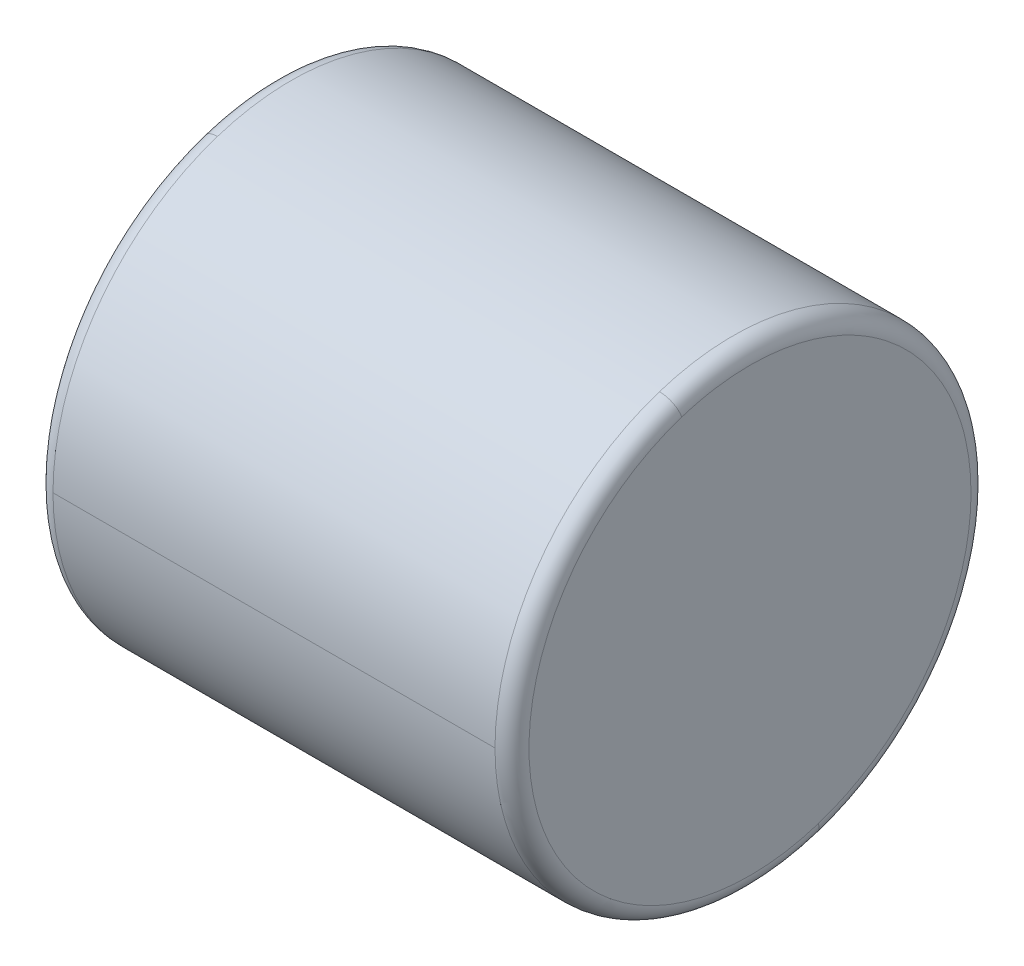
ISO-10303-21;
HEADER;
FILE_DESCRIPTION(('STEP AP214'),'2;1');
FILE_NAME('part.step','',(''),(''),'','','');
FILE_SCHEMA(('AUTOMOTIVE_DESIGN { 1 0 10303 214 1 1 1 1 }'));
ENDSEC;
DATA;
#1=APPLICATION_CONTEXT('core data for automotive mechanical design processes');
#2=APPLICATION_PROTOCOL_DEFINITION('international standard','automotive_design',2000,#1);
#3=PRODUCT_CONTEXT('',#1,'mechanical');
#4=PRODUCT('Part','Part','',(#3));
#5=PRODUCT_RELATED_PRODUCT_CATEGORY('part','',(#4));
#6=PRODUCT_DEFINITION_FORMATION('','',#4);
#7=PRODUCT_DEFINITION_CONTEXT('part definition',#1,'design');
#8=PRODUCT_DEFINITION('design','',#6,#7);
#9=PRODUCT_DEFINITION_SHAPE('','',#8);
#10=(LENGTH_UNIT() NAMED_UNIT(*) SI_UNIT(.MILLI.,.METRE.));
#11=(NAMED_UNIT(*) PLANE_ANGLE_UNIT() SI_UNIT($,.RADIAN.));
#12=(NAMED_UNIT(*) SI_UNIT($,.STERADIAN.) SOLID_ANGLE_UNIT());
#13=UNCERTAINTY_MEASURE_WITH_UNIT(LENGTH_MEASURE(1.E-05),#10,'distance_accuracy_value','');
#14=(GEOMETRIC_REPRESENTATION_CONTEXT(3) GLOBAL_UNCERTAINTY_ASSIGNED_CONTEXT((#13)) GLOBAL_UNIT_ASSIGNED_CONTEXT((#10,
#11,#12)) REPRESENTATION_CONTEXT('',''));
#15=CARTESIAN_POINT('',(0.,0.,0.));
#16=DIRECTION('',(0.,0.,1.));
#17=DIRECTION('',(1.,0.,0.));
#18=AXIS2_PLACEMENT_3D('',#15,#16,#17);
#19=CARTESIAN_POINT('',(4.,43.,0.));
#20=DIRECTION('',(1.,0.,0.));
#21=DIRECTION('',(0.,0.,-1.));
#22=AXIS2_PLACEMENT_3D('',#19,#20,#21);
#23=PLANE('',#22);
#24=CARTESIAN_POINT('',(4.,49.1818673559181,2.00861046343702));
#25=CARTESIAN_POINT('',(4.,49.1490036565323,2.10976183082609));
#26=CARTESIAN_POINT('',(4.,49.1136531930902,2.21010499774414));
#27=CARTESIAN_POINT('',(4.,49.0380731706768,2.40893671890096));
#28=CARTESIAN_POINT('',(4.,48.9978436117054,2.50742527313974));
#29=CARTESIAN_POINT('',(4.,48.9125998308166,2.70230955720075));
#30=CARTESIAN_POINT('',(4.,48.8675856088991,2.79870528702298));
#31=CARTESIAN_POINT('',(4.,48.7728816108932,2.98917194948772));
#32=CARTESIAN_POINT('',(4.,48.7231918348049,3.08324288213022));
#33=CARTESIAN_POINT('',(4.,48.6192562571407,3.26883325732977));
#34=CARTESIAN_POINT('',(4.,48.565010455565,3.36035269988683));
#35=CARTESIAN_POINT('',(4.,48.4520935575993,3.54061963472633));
#36=CARTESIAN_POINT('',(4.,48.3934224612094,3.62936712700877));
#37=CARTESIAN_POINT('',(4.,48.2717963046215,3.8038763559497));
#38=CARTESIAN_POINT('',(4.,48.2088412444235,3.88963809260819));
#39=CARTESIAN_POINT('',(4.,48.0787988279044,4.0579692040699));
#40=CARTESIAN_POINT('',(4.,48.0117114715833,4.14053857887311));
#41=CARTESIAN_POINT('',(4.,47.8735660812164,4.30228604941871));
#42=CARTESIAN_POINT('',(4.,47.8025080471705,4.38146414516109));
#43=CARTESIAN_POINT('',(4.,47.6565924866283,4.53623831071082));
#44=CARTESIAN_POINT('',(4.,47.5817349601319,4.61183438051817));
#45=CARTESIAN_POINT('',(4.,47.4284007529607,4.75926237661915));
#46=CARTESIAN_POINT('',(4.,47.3499240722859,4.83109430291278));
#47=CARTESIAN_POINT('',(4.,47.189540613973,4.97082096259087));
#48=CARTESIAN_POINT('',(4.,47.107633836335,5.03871569597533));
#49=CARTESIAN_POINT('',(4.,46.9405875046923,5.17040440547367));
#50=CARTESIAN_POINT('',(4.,46.8554479506878,5.23419838158756));
#51=CARTESIAN_POINT('',(4.,46.6821411749564,5.35753189126909));
#52=CARTESIAN_POINT('',(4.,46.5939739532296,5.41707142483674));
#53=CARTESIAN_POINT('',(4.,46.414824244613,5.53175261347425));
#54=CARTESIAN_POINT('',(4.,46.3238417577232,5.58689426854412));
#55=CARTESIAN_POINT('',(4.,46.1392807035609,5.6926468591092));
#56=CARTESIAN_POINT('',(4.,46.0457021362883,5.74325779460442));
#57=CARTESIAN_POINT('',(4.,45.8561743603254,5.83982701984359));
#58=CARTESIAN_POINT('',(4.,45.7602251516351,5.88578530958755));
#59=CARTESIAN_POINT('',(4.,45.5661872428846,5.97293852577874));
#60=CARTESIAN_POINT('',(4.,45.4680985428244,6.01413345222598));
#61=CARTESIAN_POINT('',(4.,45.2700179556042,6.09166069963766));
#62=CARTESIAN_POINT('',(4.,45.1700260684442,6.12799302060212));
#63=CARTESIAN_POINT('',(4.,44.9683799962387,6.1957075293047));
#64=CARTESIAN_POINT('',(4.,44.8667258111932,6.22708971704283));
#65=CARTESIAN_POINT('',(4.,44.6620000370525,6.28482835685375));
#66=CARTESIAN_POINT('',(4.,44.5589284479572,6.31118480892654));
#67=CARTESIAN_POINT('',(4.,44.3516161742031,6.3588084824052));
#68=CARTESIAN_POINT('',(4.,44.2473754895441,6.38007570381106));
#69=CARTESIAN_POINT('',(4.,44.0379761496023,6.41746968135668));
#70=CARTESIAN_POINT('',(4.,43.9328174943195,6.43359643749646));
#71=CARTESIAN_POINT('',(4.,43.7218355495413,6.46067063374183));
#72=CARTESIAN_POINT('',(4.,43.6160122600459,6.47161807384743));
#73=CARTESIAN_POINT('',(4.,43.403955984416,6.48830726468237));
#74=CARTESIAN_POINT('',(4.,43.2977229982815,6.49404901541171));
#75=CARTESIAN_POINT('',(4.,43.085103253942,6.5003129951137));
#76=CARTESIAN_POINT('',(4.,42.9787164957369,6.50083522408635));
#77=CARTESIAN_POINT('',(4.,42.766045502275,6.49665890217963));
#78=CARTESIAN_POINT('',(4.,42.6597612670182,6.49196035130025));
#79=CARTESIAN_POINT('',(4.,42.447551367485,6.47735378891009));
#80=CARTESIAN_POINT('',(4.,42.3416257032086,6.4674457773993));
#81=CARTESIAN_POINT('',(4.,42.1303881298396,6.44244416301388));
#82=CARTESIAN_POINT('',(4.,42.0250762207469,6.42735056013925));
#83=CARTESIAN_POINT('',(4.,41.8153198633583,6.39201412483752));
#84=CARTESIAN_POINT('',(4.,41.7108754150625,6.37177129241041));
#85=CARTESIAN_POINT('',(4.,41.503105595092,6.3261851647601));
#86=CARTESIAN_POINT('',(4.,41.3997802234173,6.3008418695369));
#87=CARTESIAN_POINT('',(4.,41.1944974765596,6.2451158705124));
#88=CARTESIAN_POINT('',(4.,41.0925401013765,6.2147331667111));
#89=CARTESIAN_POINT('',(4.,40.8902389717494,6.14900154512508));
#90=CARTESIAN_POINT('',(4.,40.7898952173053,6.11365262734036));
#91=CARTESIAN_POINT('',(4.,40.5910630660496,6.03807373642664));
#92=CARTESIAN_POINT('',(4.,40.4925746692379,5.99784376329764));
#93=CARTESIAN_POINT('',(4.,40.2976905004216,5.91259967922435));
#94=CARTESIAN_POINT('',(4.,40.2012947284169,5.86758556828006));
#95=CARTESIAN_POINT('',(4.,40.0108280350724,5.77288165151224));
#96=CARTESIAN_POINT('',(4.,39.9167571137327,5.7231918456887));
#97=CARTESIAN_POINT('',(4.,39.7311667468073,5.61925624625692));
#98=CARTESIAN_POINT('',(4.,39.6396473012217,5.56501045264868));
#99=CARTESIAN_POINT('',(4.,39.4593803641651,5.45209356051565));
#100=CARTESIAN_POINT('',(4.,39.3706328726942,5.39342246199088));
#101=CARTESIAN_POINT('',(4.,39.1961236443473,5.27179630384011));
#102=CARTESIAN_POINT('',(4.,39.1103619074714,5.20884124421412));
#103=CARTESIAN_POINT('',(4.,38.9420307958505,5.07879882811379));
#104=CARTESIAN_POINT('',(4.,38.8594614211056,5.01171147163945));
#105=CARTESIAN_POINT('',(4.,38.6977139506026,4.87356608116032));
#106=CARTESIAN_POINT('',(4.,38.6185358548446,4.80250804715552));
#107=CARTESIAN_POINT('',(4.,38.4637616892835,4.65659248664335));
#108=CARTESIAN_POINT('',(4.,38.3881656194803,4.58173496013597));
#109=CARTESIAN_POINT('',(4.,38.2407376233824,4.42840075295672));
#110=CARTESIAN_POINT('',(4.,38.1689056970876,4.34992407228486));
#111=CARTESIAN_POINT('',(4.,38.0291790374087,4.18954061397413));
#112=CARTESIAN_POINT('',(4.,37.9612843040246,4.10763383633527));
#113=CARTESIAN_POINT('',(4.,37.8295955945264,3.94058750469206));
#114=CARTESIAN_POINT('',(4.,37.7658016184125,3.85544795068772));
#115=CARTESIAN_POINT('',(4.,37.6424681087309,3.68214117495649));
#116=CARTESIAN_POINT('',(4.,37.5829285751633,3.5939739532296));
#117=CARTESIAN_POINT('',(4.,37.4682473865258,3.41482424461297));
#118=CARTESIAN_POINT('',(4.,37.4131057314559,3.32384175772322));
#119=CARTESIAN_POINT('',(4.,37.3073531408908,3.1392807035609));
#120=CARTESIAN_POINT('',(4.,37.2567422053956,3.04570213628832));
#121=CARTESIAN_POINT('',(4.,37.1601729801564,2.85617436032543));
#122=CARTESIAN_POINT('',(4.,37.1142146904125,2.76022515163511));
#123=CARTESIAN_POINT('',(4.,37.0270614742213,2.56618724288461));
#124=CARTESIAN_POINT('',(4.,36.985866547774,2.46809854282443));
#125=CARTESIAN_POINT('',(4.,36.9083393003624,2.27001795560423));
#126=CARTESIAN_POINT('',(4.,36.872006979398,2.17002606844422));
#127=CARTESIAN_POINT('',(4.,36.8042924706952,1.96837999623869));
#128=CARTESIAN_POINT('',(4.,36.7729102829569,1.86672581119317));
#129=CARTESIAN_POINT('',(4.,36.7151716431465,1.6620000370526));
#130=CARTESIAN_POINT('',(4.,36.6888151910746,1.55892844795756));
#131=CARTESIAN_POINT('',(4.,36.6411915175937,1.35161617420277));
#132=CARTESIAN_POINT('',(4.,36.6199242961848,1.24737548954301));
#133=CARTESIAN_POINT('',(4.,36.5825303186475,1.03797614960349));
#134=CARTESIAN_POINT('',(4.,36.5664035625191,0.93281749432373));
#135=CARTESIAN_POINT('',(4.,36.5393293662426,0.72183554953708));
#136=CARTESIAN_POINT('',(4.,36.5283819260946,0.61601226003019));
#137=CARTESIAN_POINT('',(4.,36.5116927353755,0.403955984431771));
#138=CARTESIAN_POINT('',(4.,36.5059509848045,0.297722998340242));
#139=CARTESIAN_POINT('',(4.,36.4996870046701,0.0851032538832987));
#140=CARTESIAN_POINT('',(4.,36.4991647751069,-0.0212835044821154));
#141=CARTESIAN_POINT('',(4.,36.5033410986271,-0.233954497505988));
#142=CARTESIAN_POINT('',(4.,36.5080396517107,-0.340238732164446));
#143=CARTESIAN_POINT('',(4.,36.522646208079,-0.552448633332304));
#144=CARTESIAN_POINT('',(4.,36.5325542113638,-0.658374299841702));
#145=CARTESIAN_POINT('',(4.,36.557555848223,-0.869611867110034));
#146=CARTESIAN_POINT('',(4.,36.5726494817975,-0.974923767868967));
#147=CARTESIAN_POINT('',(4.,36.6079858332257,-1.18468014802579));
#148=CARTESIAN_POINT('',(4.,36.6282285510794,-1.28912462742367));
#149=CARTESIAN_POINT('',(4.,36.6738149917501,-1.49689436242175));
#150=CARTESIAN_POINT('',(4.,36.6991587145672,-1.60021961802193));
#151=CARTESIAN_POINT('',(4.,36.7548835453835,-1.80550268200117));
#152=CARTESIAN_POINT('',(4.,36.7852646533825,-1.90746049038023));
#153=CARTESIAN_POINT('',(4.,36.8181326440819,-2.008610463437));
#154=B_SPLINE_CURVE_WITH_KNOTS('',3,(#24,#25,#26,#27,#28,#29,#30,#31,#32,#33,#34,#35,#36,#37,
#38,#39,#40,#41,#42,#43,#44,#45,#46,#47,#48,#49,#50,#51,#52,#53,#54,#55,#56,#57,#58,#59,#60,#61,
#62,#63,#64,#65,#66,#67,#68,#69,#70,#71,#72,#73,#74,#75,#76,#77,#78,#79,#80,#81,#82,#83,#84,#85,
#86,#87,#88,#89,#90,#91,#92,#93,#94,#95,#96,#97,#98,#99,#100,#101,#102,#103,#104,#105,#106,#107,
#108,#109,#110,#111,#112,#113,#114,#115,#116,#117,#118,#119,#120,#121,#122,#123,#124,#125,#126,
#127,#128,#129,#130,#131,#132,#133,#134,#135,#136,#137,#138,#139,#140,#141,#142,#143,#144,#145,
#146,#147,#148,#149,#150,#151,#152,#153),.UNSPECIFIED.,.F.,.F.,(4,2,2,2,2,2,2,2,2,2,2,2,2,2,2,2,
2,2,2,2,2,2,2,2,2,2,2,2,2,2,2,2,2,2,2,2,2,2,2,2,2,2,2,2,2,2,2,2,2,2,2,2,2,2,2,2,2,2,2,2,2,2,2,2,
4),(0.,0.31903597079784,0.638071941595675,0.957107912393514,1.27614388319135,1.59517985398919,
1.91421582478703,2.23325179558487,2.55228776638271,2.87132373718054,3.19035970797838,
3.50939567877622,3.82843164957406,4.1474676203719,4.46650359116974,4.78553956196757,
5.10457553276541,5.42361150356325,5.74264747436109,6.06168344515893,6.38071941595676,
6.6997553867546,7.01879135755244,7.33782732835028,7.65686329914812,7.97589926994596,
8.29493524074379,8.61397121154163,8.93300718233947,9.25204315313731,9.57107912393515,
9.89011509473298,10.2091510655308,10.5281870363287,10.8472230071265,11.1662589779243,
11.4852949487222,11.80433091952,12.1233668903179,12.4424028611157,12.7614388319135,
13.0804748027114,13.3995107735092,13.718546744307,14.0375827151049,14.3566186859027,
14.6756546567006,14.9946906274984,15.3137265982962,15.6327625690941,15.9517985398919,
16.2708345106897,16.5898704814876,16.9089064522854,17.2279424230833,17.5469783938811,
17.8660143646789,18.1850503354768,18.5040863062746,18.8231222770725,19.1421582478703,
19.4611942186681,19.780230189466,20.0992661602638,20.4183021310616),.UNSPECIFIED.);
#155=CARTESIAN_POINT('',(4.,49.1818673559181,2.00861046343702));
#156=VERTEX_POINT('',#155);
#157=CARTESIAN_POINT('',(4.,36.8181326440819,-2.00861046343702));
#158=VERTEX_POINT('',#157);
#159=EDGE_CURVE('E11',#156,#158,#154,.T.);
#160=ORIENTED_EDGE('',*,*,#159,.F.);
#161=CARTESIAN_POINT('',(4.,36.8181326440819,-2.00861046343702));
#162=CARTESIAN_POINT('',(4.,36.8509963434677,-2.10976183082608));
#163=CARTESIAN_POINT('',(4.,36.8863468069098,-2.21010499774414));
#164=CARTESIAN_POINT('',(4.,36.9619268293232,-2.40893671890096));
#165=CARTESIAN_POINT('',(4.,37.0021563882946,-2.50742527313974));
#166=CARTESIAN_POINT('',(4.,37.0874001691834,-2.70230955720075));
#167=CARTESIAN_POINT('',(4.,37.1324143911009,-2.79870528702298));
#168=CARTESIAN_POINT('',(4.,37.2271183891068,-2.98917194948772));
#169=CARTESIAN_POINT('',(4.,37.2768081651951,-3.08324288213022));
#170=CARTESIAN_POINT('',(4.,37.3807437428592,-3.26883325732977));
#171=CARTESIAN_POINT('',(4.,37.434989544435,-3.36035269988683));
#172=CARTESIAN_POINT('',(4.,37.5479064424007,-3.54061963472633));
#173=CARTESIAN_POINT('',(4.,37.6065775387906,-3.62936712700877));
#174=CARTESIAN_POINT('',(4.,37.7282036953785,-3.80387635594969));
#175=CARTESIAN_POINT('',(4.,37.7911587555765,-3.88963809260819));
#176=CARTESIAN_POINT('',(4.,37.9212011720956,-4.05796920406989));
#177=CARTESIAN_POINT('',(4.,37.9882885284167,-4.14053857887311));
#178=CARTESIAN_POINT('',(4.,38.1264339187836,-4.30228604941871));
#179=CARTESIAN_POINT('',(4.,38.1974919528295,-4.38146414516109));
#180=CARTESIAN_POINT('',(4.,38.3434075133717,-4.53623831071082));
#181=CARTESIAN_POINT('',(4.,38.4182650398681,-4.61183438051817));
#182=CARTESIAN_POINT('',(4.,38.5715992470393,-4.75926237661915));
#183=CARTESIAN_POINT('',(4.,38.6500759277141,-4.83109430291278));
#184=CARTESIAN_POINT('',(4.,38.8104593860269,-4.97082096259087));
#185=CARTESIAN_POINT('',(4.,38.892366163665,-5.03871569597533));
#186=CARTESIAN_POINT('',(4.,39.0594124953076,-5.17040440547367));
#187=CARTESIAN_POINT('',(4.,39.1445520493122,-5.23419838158756));
#188=CARTESIAN_POINT('',(4.,39.3178588250436,-5.35753189126909));
#189=CARTESIAN_POINT('',(4.,39.4060260467704,-5.41707142483674));
#190=CARTESIAN_POINT('',(4.,39.585175755387,-5.53175261347425));
#191=CARTESIAN_POINT('',(4.,39.6761582422768,-5.58689426854411));
#192=CARTESIAN_POINT('',(4.,39.8607192964391,-5.6926468591092));
#193=CARTESIAN_POINT('',(4.,39.9542978637117,-5.74325779460441));
#194=CARTESIAN_POINT('',(4.,40.1438256396746,-5.83982701984359));
#195=CARTESIAN_POINT('',(4.,40.2397748483649,-5.88578530958755));
#196=CARTESIAN_POINT('',(4.,40.4338127571154,-5.97293852577874));
#197=CARTESIAN_POINT('',(4.,40.5319014571756,-6.01413345222597));
#198=CARTESIAN_POINT('',(4.,40.7299820443958,-6.09166069963766));
#199=CARTESIAN_POINT('',(4.,40.8299739315558,-6.12799302060211));
#200=CARTESIAN_POINT('',(4.,41.0316200037613,-6.1957075293047));
#201=CARTESIAN_POINT('',(4.,41.1332741888068,-6.22708971704283));
#202=CARTESIAN_POINT('',(4.,41.3379999629475,-6.28482835685375));
#203=CARTESIAN_POINT('',(4.,41.4410715520428,-6.31118480892654));
#204=CARTESIAN_POINT('',(4.,41.6483838257969,-6.3588084824052));
#205=CARTESIAN_POINT('',(4.,41.7526245104559,-6.38007570381105));
#206=CARTESIAN_POINT('',(4.,41.9620238503976,-6.41746968135668));
#207=CARTESIAN_POINT('',(4.,42.0671825056805,-6.43359643749645));
#208=CARTESIAN_POINT('',(4.,42.2781644504587,-6.46067063374183));
#209=CARTESIAN_POINT('',(4.,42.3839877399541,-6.47161807384743));
#210=CARTESIAN_POINT('',(4.,42.596044015584,-6.48830726468237));
#211=CARTESIAN_POINT('',(4.,42.7022770017184,-6.49404901541171));
#212=CARTESIAN_POINT('',(4.,42.914896746058,-6.5003129951137));
#213=CARTESIAN_POINT('',(4.,43.0212835042631,-6.50083522408635));
#214=CARTESIAN_POINT('',(4.,43.233954497725,-6.49665890217963));
#215=CARTESIAN_POINT('',(4.,43.3402387329818,-6.49196035130025));
#216=CARTESIAN_POINT('',(4.,43.552448632515,-6.47735378891009));
#217=CARTESIAN_POINT('',(4.,43.6583742967913,-6.4674457773993));
#218=CARTESIAN_POINT('',(4.,43.8696118701604,-6.44244416301389));
#219=CARTESIAN_POINT('',(4.,43.9749237792531,-6.42735056013925));
#220=CARTESIAN_POINT('',(4.,44.1846801366416,-6.39201412483752));
#221=CARTESIAN_POINT('',(4.,44.2891245849375,-6.37177129241041));
#222=CARTESIAN_POINT('',(4.,44.496894404908,-6.3261851647601));
#223=CARTESIAN_POINT('',(4.,44.6002197765827,-6.3008418695369));
#224=CARTESIAN_POINT('',(4.,44.8055025234404,-6.2451158705124));
#225=CARTESIAN_POINT('',(4.,44.9074598986234,-6.2147331667111));
#226=CARTESIAN_POINT('',(4.,45.1097610282506,-6.14900154512509));
#227=CARTESIAN_POINT('',(4.,45.2101047826947,-6.11365262734037));
#228=CARTESIAN_POINT('',(4.,45.4089369339504,-6.03807373642664));
#229=CARTESIAN_POINT('',(4.,45.507425330762,-5.99784376329764));
#230=CARTESIAN_POINT('',(4.,45.7023094995784,-5.91259967922435));
#231=CARTESIAN_POINT('',(4.,45.7987052715831,-5.86758556828006));
#232=CARTESIAN_POINT('',(4.,45.9891719649276,-5.77288165151224));
#233=CARTESIAN_POINT('',(4.,46.0832428862673,-5.7231918456887));
#234=CARTESIAN_POINT('',(4.,46.2688332531927,-5.61925624625693));
#235=CARTESIAN_POINT('',(4.,46.3603526987783,-5.56501045264868));
#236=CARTESIAN_POINT('',(4.,46.5406196358348,-5.45209356051566));
#237=CARTESIAN_POINT('',(4.,46.6293671273058,-5.39342246199088));
#238=CARTESIAN_POINT('',(4.,46.8038763556526,-5.27179630384011));
#239=CARTESIAN_POINT('',(4.,46.8896380925286,-5.20884124421413));
#240=CARTESIAN_POINT('',(4.,47.0579692041495,-5.0787988281138));
#241=CARTESIAN_POINT('',(4.,47.1405385788944,-5.01171147163946));
#242=CARTESIAN_POINT('',(4.,47.3022860493974,-4.87356608116032));
#243=CARTESIAN_POINT('',(4.,47.3814641451554,-4.80250804715553));
#244=CARTESIAN_POINT('',(4.,47.5362383107165,-4.65659248664335));
#245=CARTESIAN_POINT('',(4.,47.6118343805197,-4.58173496013598));
#246=CARTESIAN_POINT('',(4.,47.7592623766176,-4.42840075295673));
#247=CARTESIAN_POINT('',(4.,47.8310943029123,-4.34992407228487));
#248=CARTESIAN_POINT('',(4.,47.9708209625913,-4.18954061397414));
#249=CARTESIAN_POINT('',(4.,48.0387156959754,-4.10763383633528));
#250=CARTESIAN_POINT('',(4.,48.1704044054735,-3.94058750469207));
#251=CARTESIAN_POINT('',(4.,48.2341983815875,-3.85544795068773));
#252=CARTESIAN_POINT('',(4.,48.3575318912691,-3.6821411749565));
#253=CARTESIAN_POINT('',(4.,48.4170714248367,-3.59397395322961));
#254=CARTESIAN_POINT('',(4.,48.5317526134742,-3.41482424461298));
#255=CARTESIAN_POINT('',(4.,48.5868942685441,-3.32384175772323));
#256=CARTESIAN_POINT('',(4.,48.6926468591092,-3.1392807035609));
#257=CARTESIAN_POINT('',(4.,48.7432577946044,-3.04570213628833));
#258=CARTESIAN_POINT('',(4.,48.8398270198436,-2.85617436032544));
#259=CARTESIAN_POINT('',(4.,48.8857853095875,-2.76022515163512));
#260=CARTESIAN_POINT('',(4.,48.9729385257787,-2.56618724288462));
#261=CARTESIAN_POINT('',(4.,49.014133452226,-2.46809854282444));
#262=CARTESIAN_POINT('',(4.,49.0916606996376,-2.27001795560424));
#263=CARTESIAN_POINT('',(4.,49.127993020602,-2.17002606844423));
#264=CARTESIAN_POINT('',(4.,49.1957075293048,-1.96837999623869));
#265=CARTESIAN_POINT('',(4.,49.2270897170431,-1.86672581119317));
#266=CARTESIAN_POINT('',(4.,49.2848283568534,-1.66200003705261));
#267=CARTESIAN_POINT('',(4.,49.3111848089254,-1.55892844795757));
#268=CARTESIAN_POINT('',(4.,49.3588084824063,-1.35161617420277));
#269=CARTESIAN_POINT('',(4.,49.3800757038152,-1.24737548954302));
#270=CARTESIAN_POINT('',(4.,49.4174696813525,-1.0379761496035));
#271=CARTESIAN_POINT('',(4.,49.4335964374809,-0.932817494323739));
#272=CARTESIAN_POINT('',(4.,49.4606706337573,-0.721835549537089));
#273=CARTESIAN_POINT('',(4.,49.4716180739053,-0.616012260030201));
#274=CARTESIAN_POINT('',(4.,49.4883072646244,-0.403955984431783));
#275=CARTESIAN_POINT('',(4.,49.4940490151955,-0.297722998340255));
#276=CARTESIAN_POINT('',(4.,49.5003129953299,-0.0851032538833112));
#277=CARTESIAN_POINT('',(4.,49.5008352248931,0.021283504482103));
#278=CARTESIAN_POINT('',(4.,49.4966589013729,0.233954497505976));
#279=CARTESIAN_POINT('',(4.,49.4919603482893,0.340238732164434));
#280=CARTESIAN_POINT('',(4.,49.477353791921,0.552448633332291));
#281=CARTESIAN_POINT('',(4.,49.4674457886362,0.65837429984169));
#282=CARTESIAN_POINT('',(4.,49.442444151777,0.869611867110024));
#283=CARTESIAN_POINT('',(4.,49.4273505182025,0.974923767868959));
#284=CARTESIAN_POINT('',(4.,49.3920141667743,1.18468014802578));
#285=CARTESIAN_POINT('',(4.,49.3717714489206,1.28912462742367));
#286=CARTESIAN_POINT('',(4.,49.3261850082499,1.49689436242174));
#287=CARTESIAN_POINT('',(4.,49.3008412854327,1.60021961802193));
#288=CARTESIAN_POINT('',(4.,49.2451164546165,1.80550268200117));
#289=CARTESIAN_POINT('',(4.,49.2147353466174,1.90746049038022));
#290=CARTESIAN_POINT('',(4.,49.1818673559181,2.00861046343699));
#291=B_SPLINE_CURVE_WITH_KNOTS('',3,(#161,#162,#163,#164,#165,#166,#167,#168,#169,#170,#171,
#172,#173,#174,#175,#176,#177,#178,#179,#180,#181,#182,#183,#184,#185,#186,#187,#188,#189,#190,
#191,#192,#193,#194,#195,#196,#197,#198,#199,#200,#201,#202,#203,#204,#205,#206,#207,#208,#209,
#210,#211,#212,#213,#214,#215,#216,#217,#218,#219,#220,#221,#222,#223,#224,#225,#226,#227,#228,
#229,#230,#231,#232,#233,#234,#235,#236,#237,#238,#239,#240,#241,#242,#243,#244,#245,#246,#247,
#248,#249,#250,#251,#252,#253,#254,#255,#256,#257,#258,#259,#260,#261,#262,#263,#264,#265,#266,
#267,#268,#269,#270,#271,#272,#273,#274,#275,#276,#277,#278,#279,#280,#281,#282,#283,#284,#285,
#286,#287,#288,#289,#290),.UNSPECIFIED.,.F.,.F.,(4,2,2,2,2,2,2,2,2,2,2,2,2,2,2,2,2,2,2,2,2,2,2,
2,2,2,2,2,2,2,2,2,2,2,2,2,2,2,2,2,2,2,2,2,2,2,2,2,2,2,2,2,2,2,2,2,2,2,2,2,2,2,2,2,4),(0.,
0.319035970797839,0.638071941595673,0.957107912393512,1.27614388319135,1.59517985398919,
1.91421582478703,2.23325179558487,2.55228776638271,2.87132373718054,3.19035970797838,
3.50939567877622,3.82843164957405,4.14746762037189,4.46650359116973,4.78553956196757,
5.10457553276541,5.42361150356325,5.74264747436109,6.06168344515892,6.38071941595677,
6.6997553867546,7.01879135755243,7.33782732835027,7.65686329914811,7.97589926994595,
8.29493524074379,8.61397121154162,8.93300718233946,9.2520431531373,9.57107912393514,
9.89011509473298,10.2091510655308,10.5281870363287,10.8472230071265,11.1662589779243,
11.4852949487222,11.80433091952,12.1233668903178,12.4424028611157,12.7614388319135,
13.0804748027114,13.3995107735092,13.718546744307,14.0375827151049,14.3566186859027,
14.6756546567005,14.9946906274984,15.3137265982962,15.6327625690941,15.9517985398919,
16.2708345106897,16.5898704814876,16.9089064522854,17.2279424230833,17.5469783938811,
17.8660143646789,18.1850503354768,18.5040863062746,18.8231222770724,19.1421582478703,
19.4611942186681,19.780230189466,20.0992661602638,20.4183021310616),.UNSPECIFIED.);
#292=EDGE_CURVE('E26',#158,#156,#291,.T.);
#293=ORIENTED_EDGE('',*,*,#292,.F.);
#294=EDGE_LOOP('',(#160,#293));
#295=FACE_BOUND('',#294,.T.);
#296=ADVANCED_FACE('F17',(#295),#23,.F.);
#297=CARTESIAN_POINT('',(4.50000000000043,43.,0.));
#298=DIRECTION('',(1.,0.,0.));
#299=DIRECTION('',(0.,-0.309016994374947,0.951056516295154));
#300=AXIS2_PLACEMENT_3D('',#297,#298,#299);
#301=TOROIDAL_SURFACE('',#300,6.49999999999957,0.500000000000432);
#302=CARTESIAN_POINT('',(4.50000000000043,36.8181326440819,-2.00861046343702));
#303=DIRECTION('',(0.,0.309016994374946,-0.951056516295154));
#304=DIRECTION('',(-8.63309423947774E-13,-0.951056516295154,-0.309016994374946));
#305=AXIS2_PLACEMENT_3D('',#302,#303,#304);
#306=CIRCLE('',#305,0.500000000000433);
#307=CARTESIAN_POINT('',(4.5,36.3426043859339,-2.16311896062463));
#308=VERTEX_POINT('',#307);
#309=EDGE_CURVE('E139',#308,#158,#306,.T.);
#310=ORIENTED_EDGE('',*,*,#309,.T.);
#311=ORIENTED_EDGE('',*,*,#292,.T.);
#312=CARTESIAN_POINT('',(4.50000000000043,49.1818673559181,2.00861046343702));
#313=DIRECTION('',(0.,-0.309016994374946,0.951056516295154));
#314=DIRECTION('',(-8.61533067108375E-13,0.951056516295154,0.309016994374946));
#315=AXIS2_PLACEMENT_3D('',#312,#313,#314);
#316=CIRCLE('',#315,0.500000000000433);
#317=CARTESIAN_POINT('',(4.5,49.6573956140661,2.16311896062463));
#318=VERTEX_POINT('',#317);
#319=EDGE_CURVE('E135',#318,#156,#316,.T.);
#320=ORIENTED_EDGE('',*,*,#319,.F.);
#321=CARTESIAN_POINT('',(4.5,43.,0.));
#322=DIRECTION('',(1.,0.,0.));
#323=DIRECTION('',(0.,0.,-1.));
#324=AXIS2_PLACEMENT_3D('',#321,#322,#323);
#325=CIRCLE('',#324,7.);
#326=CARTESIAN_POINT('',(4.5,43.,-7.));
#327=VERTEX_POINT('',#326);
#328=EDGE_CURVE('E130',#327,#318,#325,.T.);
#329=ORIENTED_EDGE('',*,*,#328,.F.);
#330=CARTESIAN_POINT('',(4.5,43.,0.));
#331=DIRECTION('',(1.,0.,0.));
#332=DIRECTION('',(0.,0.,-1.));
#333=AXIS2_PLACEMENT_3D('',#330,#331,#332);
#334=CIRCLE('',#333,7.);
#335=EDGE_CURVE('E125',#308,#327,#334,.T.);
#336=ORIENTED_EDGE('',*,*,#335,.F.);
#337=EDGE_LOOP('',(#310,#311,#320,#329,#336));
#338=FACE_BOUND('',#337,.T.);
#339=ADVANCED_FACE('F146',(#338),#301,.T.);
#340=CARTESIAN_POINT('',(18.,43.,0.));
#341=DIRECTION('',(1.,0.,0.));
#342=DIRECTION('',(0.,1.,0.));
#343=AXIS2_PLACEMENT_3D('',#340,#341,#342);
#344=CYLINDRICAL_SURFACE('',#343,7.);
#345=DIRECTION('',(1.,0.,0.));
#346=VECTOR('',#345,1.);
#347=CARTESIAN_POINT('',(4.5,43.,7.));
#348=LINE('',#347,#346);
#349=CARTESIAN_POINT('',(4.5,43.,7.));
#350=VERTEX_POINT('',#349);
#351=CARTESIAN_POINT('',(17.5,43.,7.));
#352=VERTEX_POINT('',#351);
#353=EDGE_CURVE('E92',#350,#352,#348,.T.);
#354=ORIENTED_EDGE('',*,*,#353,.F.);
#355=CARTESIAN_POINT('',(4.5,43.,0.));
#356=DIRECTION('',(1.,0.,0.));
#357=DIRECTION('',(0.,0.,-1.));
#358=AXIS2_PLACEMENT_3D('',#355,#356,#357);
#359=CIRCLE('',#358,7.);
#360=EDGE_CURVE('E117',#350,#308,#359,.T.);
#361=ORIENTED_EDGE('',*,*,#360,.T.);
#362=ORIENTED_EDGE('',*,*,#335,.T.);
#363=DIRECTION('',(1.,0.,0.));
#364=VECTOR('',#363,1.);
#365=CARTESIAN_POINT('',(4.5,43.,-7.));
#366=LINE('',#365,#364);
#367=CARTESIAN_POINT('',(17.5,43.,-7.));
#368=VERTEX_POINT('',#367);
#369=EDGE_CURVE('E113',#327,#368,#366,.T.);
#370=ORIENTED_EDGE('',*,*,#369,.T.);
#371=CARTESIAN_POINT('',(17.5,43.,0.));
#372=DIRECTION('',(1.,0.,0.));
#373=DIRECTION('',(0.,0.,-1.));
#374=AXIS2_PLACEMENT_3D('',#371,#372,#373);
#375=CIRCLE('',#374,7.);
#376=CARTESIAN_POINT('',(17.5,36.3426043859339,-2.16311896062463));
#377=VERTEX_POINT('',#376);
#378=EDGE_CURVE('E84',#377,#368,#375,.T.);
#379=ORIENTED_EDGE('',*,*,#378,.F.);
#380=CARTESIAN_POINT('',(17.5,43.,0.));
#381=DIRECTION('',(1.,0.,0.));
#382=DIRECTION('',(0.,0.,-1.));
#383=AXIS2_PLACEMENT_3D('',#380,#381,#382);
#384=CIRCLE('',#383,7.);
#385=EDGE_CURVE('E106',#352,#377,#384,.T.);
#386=ORIENTED_EDGE('',*,*,#385,.F.);
#387=EDGE_LOOP('',(#354,#361,#362,#370,#379,#386));
#388=FACE_BOUND('',#387,.T.);
#389=ADVANCED_FACE('F155',(#388),#344,.T.);
#390=CARTESIAN_POINT('',(17.4999999999991,43.,0.));
#391=DIRECTION('',(1.,0.,0.));
#392=DIRECTION('',(0.,0.309016994374947,-0.951056516295154));
#393=AXIS2_PLACEMENT_3D('',#390,#391,#392);
#394=TOROIDAL_SURFACE('',#393,6.49999999999906,0.500000000000944);
#395=CARTESIAN_POINT('',(17.4999999999991,36.8181326440824,-2.00861046343687));
#396=DIRECTION('',(0.,0.309016994374947,-0.951056516295154));
#397=DIRECTION('',(1.,0.,0.));
#398=AXIS2_PLACEMENT_3D('',#395,#396,#397);
#399=CIRCLE('',#398,0.500000000000945);
#400=CARTESIAN_POINT('',(18.,36.8181326440824,-2.00861046343687));
#401=VERTEX_POINT('',#400);
#402=EDGE_CURVE('E102',#401,#377,#399,.T.);
#403=ORIENTED_EDGE('',*,*,#402,.F.);
#404=CARTESIAN_POINT('',(18.,43.,0.));
#405=DIRECTION('',(1.,0.,0.));
#406=DIRECTION('',(0.,0.,-1.));
#407=AXIS2_PLACEMENT_3D('',#404,#405,#406);
#408=CIRCLE('',#407,6.5);
#409=CARTESIAN_POINT('',(18.,49.1818673559176,2.00861046343687));
#410=VERTEX_POINT('',#409);
#411=EDGE_CURVE('E74',#410,#401,#408,.T.);
#412=ORIENTED_EDGE('',*,*,#411,.F.);
#413=CARTESIAN_POINT('',(17.4999999999991,49.1818673559176,2.00861046343687));
#414=DIRECTION('',(0.,-0.309016994374947,0.951056516295154));
#415=DIRECTION('',(1.,0.,0.));
#416=AXIS2_PLACEMENT_3D('',#413,#414,#415);
#417=CIRCLE('',#416,0.500000000000945);
#418=CARTESIAN_POINT('',(17.5,49.6573956140661,2.16311896062463));
#419=VERTEX_POINT('',#418);
#420=EDGE_CURVE('E67',#410,#419,#417,.T.);
#421=ORIENTED_EDGE('',*,*,#420,.T.);
#422=CARTESIAN_POINT('',(17.5,43.,0.));
#423=DIRECTION('',(1.,0.,0.));
#424=DIRECTION('',(0.,0.,-1.));
#425=AXIS2_PLACEMENT_3D('',#422,#423,#424);
#426=CIRCLE('',#425,7.);
#427=EDGE_CURVE('E72',#419,#352,#426,.T.);
#428=ORIENTED_EDGE('',*,*,#427,.T.);
#429=ORIENTED_EDGE('',*,*,#385,.T.);
#430=EDGE_LOOP('',(#403,#412,#421,#428,#429));
#431=FACE_BOUND('',#430,.T.);
#432=ADVANCED_FACE('F69',(#431),#394,.T.);
#433=CARTESIAN_POINT('',(18.,43.,0.));
#434=DIRECTION('',(1.,0.,0.));
#435=DIRECTION('',(0.,-1.,0.));
#436=AXIS2_PLACEMENT_3D('',#433,#434,#435);
#437=CYLINDRICAL_SURFACE('',#436,7.);
#438=ORIENTED_EDGE('',*,*,#353,.T.);
#439=ORIENTED_EDGE('',*,*,#427,.F.);
#440=CARTESIAN_POINT('',(17.5,43.,0.));
#441=DIRECTION('',(1.,0.,0.));
#442=DIRECTION('',(0.,0.,-1.));
#443=AXIS2_PLACEMENT_3D('',#440,#441,#442);
#444=CIRCLE('',#443,7.);
#445=EDGE_CURVE('E81',#368,#419,#444,.T.);
#446=ORIENTED_EDGE('',*,*,#445,.F.);
#447=ORIENTED_EDGE('',*,*,#369,.F.);
#448=ORIENTED_EDGE('',*,*,#328,.T.);
#449=CARTESIAN_POINT('',(4.5,43.,0.));
#450=DIRECTION('',(1.,0.,0.));
#451=DIRECTION('',(0.,0.,-1.));
#452=AXIS2_PLACEMENT_3D('',#449,#450,#451);
#453=CIRCLE('',#452,7.);
#454=EDGE_CURVE('E87',#318,#350,#453,.T.);
#455=ORIENTED_EDGE('',*,*,#454,.T.);
#456=EDGE_LOOP('',(#438,#439,#446,#447,#448,#455));
#457=FACE_BOUND('',#456,.T.);
#458=ADVANCED_FACE('F90',(#457),#437,.T.);
#459=CARTESIAN_POINT('',(4.50000000000043,43.,0.));
#460=DIRECTION('',(1.,0.,0.));
#461=DIRECTION('',(0.,0.309016994374947,-0.951056516295154));
#462=AXIS2_PLACEMENT_3D('',#459,#460,#461);
#463=TOROIDAL_SURFACE('',#462,6.49999999999957,0.500000000000432);
#464=ORIENTED_EDGE('',*,*,#309,.F.);
#465=ORIENTED_EDGE('',*,*,#360,.F.);
#466=ORIENTED_EDGE('',*,*,#454,.F.);
#467=ORIENTED_EDGE('',*,*,#319,.T.);
#468=ORIENTED_EDGE('',*,*,#159,.T.);
#469=EDGE_LOOP('',(#464,#465,#466,#467,#468));
#470=FACE_BOUND('',#469,.T.);
#471=ADVANCED_FACE('F164',(#470),#463,.T.);
#472=CARTESIAN_POINT('',(17.4999999999991,43.,0.));
#473=DIRECTION('',(1.,0.,0.));
#474=DIRECTION('',(0.,-0.309016994374947,0.951056516295154));
#475=AXIS2_PLACEMENT_3D('',#472,#473,#474);
#476=TOROIDAL_SURFACE('',#475,6.49999999999906,0.500000000000944);
#477=ORIENTED_EDGE('',*,*,#402,.T.);
#478=ORIENTED_EDGE('',*,*,#378,.T.);
#479=ORIENTED_EDGE('',*,*,#445,.T.);
#480=ORIENTED_EDGE('',*,*,#420,.F.);
#481=CARTESIAN_POINT('',(18.,36.8181326440815,-2.00861046343716));
#482=CARTESIAN_POINT('',(18.,37.4497476988788,-3.94983775496152));
#483=CARTESIAN_POINT('',(18.,38.8402760325109,-5.64858146145225));
#484=CARTESIAN_POINT('',(18.,40.8764097115736,-6.68340152184071));
#485=CARTESIAN_POINT('',(18.,45.2558033300307,-6.94264877194067));
#486=CARTESIAN_POINT('',(18.,48.6464254821136,-4.15877035795195));
#487=CARTESIAN_POINT('',(18.,49.6854402610218,-2.12477399472849));
#488=CARTESIAN_POINT('',(18.,49.8119048159901,0.0668705803137288));
#489=CARTESIAN_POINT('',(18.,49.1818673559185,2.00861046343716));
#490=B_SPLINE_CURVE_WITH_KNOTS('',5,(#481,#482,#483,#484,#485,#486,#487,#488,#489),
.UNSPECIFIED.,.F.,.F.,(6,3,6),(0.,1.5707963267949,3.14159265358979),.UNSPECIFIED.);
#491=EDGE_CURVE('E185',#401,#410,#490,.T.);
#492=ORIENTED_EDGE('',*,*,#491,.F.);
#493=EDGE_LOOP('',(#477,#478,#479,#480,#492));
#494=FACE_BOUND('',#493,.T.);
#495=ADVANCED_FACE('F83',(#494),#476,.T.);
#496=CARTESIAN_POINT('',(18.,49.5,0.));
#497=DIRECTION('',(-1.,0.,0.));
#498=DIRECTION('',(0.,0.,1.));
#499=AXIS2_PLACEMENT_3D('',#496,#497,#498);
#500=PLANE('',#499);
#501=ORIENTED_EDGE('',*,*,#491,.T.);
#502=ORIENTED_EDGE('',*,*,#411,.T.);
#503=EDGE_LOOP('',(#501,#502));
#504=FACE_BOUND('',#503,.T.);
#505=ADVANCED_FACE('F191',(#504),#500,.F.);
#506=CLOSED_SHELL('',(#296,#339,#389,#432,#458,#471,#495,#505));
#507=MANIFOLD_SOLID_BREP('B1',#506);
#508=ADVANCED_BREP_SHAPE_REPRESENTATION('',(#18,#507),#14);
#509=SHAPE_DEFINITION_REPRESENTATION(#9,#508);
ENDSEC;
END-ISO-10303-21;
